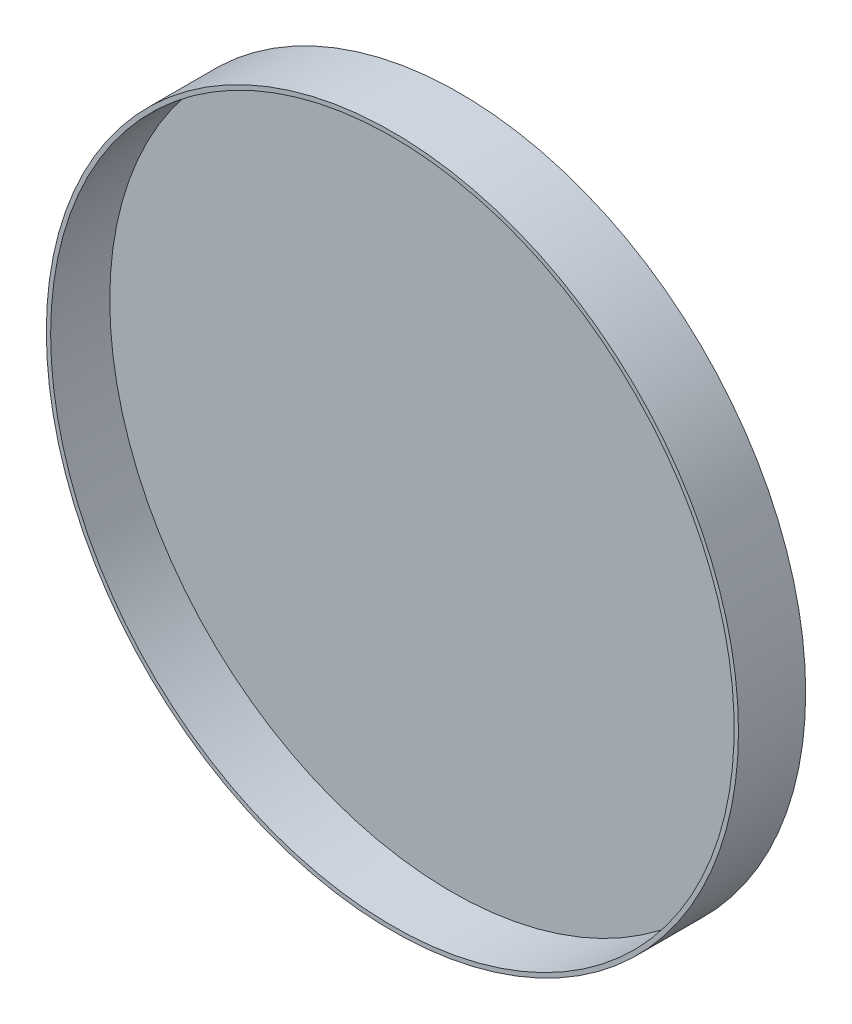
ISO-10303-21;
HEADER;
FILE_DESCRIPTION(('STEP AP214'),'2;1');
FILE_NAME('part.step','',(''),(''),'','','');
FILE_SCHEMA(('AUTOMOTIVE_DESIGN { 1 0 10303 214 1 1 1 1 }'));
ENDSEC;
DATA;
#1=APPLICATION_CONTEXT('core data for automotive mechanical design processes');
#2=APPLICATION_PROTOCOL_DEFINITION('international standard','automotive_design',2000,#1);
#3=PRODUCT_CONTEXT('',#1,'mechanical');
#4=PRODUCT('Part','Part','',(#3));
#5=PRODUCT_RELATED_PRODUCT_CATEGORY('part','',(#4));
#6=PRODUCT_DEFINITION_FORMATION('','',#4);
#7=PRODUCT_DEFINITION_CONTEXT('part definition',#1,'design');
#8=PRODUCT_DEFINITION('design','',#6,#7);
#9=PRODUCT_DEFINITION_SHAPE('','',#8);
#10=(LENGTH_UNIT() NAMED_UNIT(*) SI_UNIT(.MILLI.,.METRE.));
#11=(NAMED_UNIT(*) PLANE_ANGLE_UNIT() SI_UNIT($,.RADIAN.));
#12=(NAMED_UNIT(*) SI_UNIT($,.STERADIAN.) SOLID_ANGLE_UNIT());
#13=UNCERTAINTY_MEASURE_WITH_UNIT(LENGTH_MEASURE(1.E-05),#10,'distance_accuracy_value','');
#14=(GEOMETRIC_REPRESENTATION_CONTEXT(3) GLOBAL_UNCERTAINTY_ASSIGNED_CONTEXT((#13)) GLOBAL_UNIT_ASSIGNED_CONTEXT((#10,
#11,#12)) REPRESENTATION_CONTEXT('',''));
#15=CARTESIAN_POINT('',(0.,0.,0.));
#16=DIRECTION('',(0.,0.,1.));
#17=DIRECTION('',(1.,0.,0.));
#18=AXIS2_PLACEMENT_3D('',#15,#16,#17);
#19=CARTESIAN_POINT('',(0.,0.,0.));
#20=DIRECTION('',(0.,0.,-1.));
#21=DIRECTION('',(-1.,0.,0.));
#22=AXIS2_PLACEMENT_3D('',#19,#20,#21);
#23=PLANE('',#22);
#24=CARTESIAN_POINT('',(0.,0.,0.));
#25=DIRECTION('',(0.,0.,-1.));
#26=DIRECTION('',(-1.,0.,0.));
#27=AXIS2_PLACEMENT_3D('',#24,#25,#26);
#28=CIRCLE('',#27,32.2961);
#29=CARTESIAN_POINT('',(-32.2961,0.,0.));
#30=VERTEX_POINT('',#29);
#31=EDGE_CURVE('E25',#30,#30,#28,.F.);
#32=ORIENTED_EDGE('',*,*,#31,.T.);
#33=EDGE_LOOP('',(#32));
#34=FACE_BOUND('',#33,.T.);
#35=ADVANCED_FACE('F22',(#34),#23,.F.);
#36=CARTESIAN_POINT('',(0.,0.,5.588));
#37=DIRECTION('',(0.,0.,-1.));
#38=DIRECTION('',(-1.,0.,0.));
#39=AXIS2_PLACEMENT_3D('',#36,#37,#38);
#40=CYLINDRICAL_SURFACE('',#39,32.2961);
#41=CARTESIAN_POINT('',(0.,0.,5.588));
#42=DIRECTION('',(0.,0.,-1.));
#43=DIRECTION('',(-1.,0.,0.));
#44=AXIS2_PLACEMENT_3D('',#41,#42,#43);
#45=CIRCLE('',#44,32.2961);
#46=CARTESIAN_POINT('',(-32.2961,0.,5.588));
#47=VERTEX_POINT('',#46);
#48=EDGE_CURVE('E34',#47,#47,#45,.T.);
#49=ORIENTED_EDGE('',*,*,#48,.F.);
#50=EDGE_LOOP('',(#49));
#51=FACE_BOUND('',#50,.T.);
#52=ORIENTED_EDGE('',*,*,#31,.F.);
#53=EDGE_LOOP('',(#52));
#54=FACE_BOUND('',#53,.T.);
#55=ADVANCED_FACE('F43',(#51,#54),#40,.F.);
#56=CARTESIAN_POINT('',(0.,0.,5.588));
#57=DIRECTION('',(0.,0.,1.));
#58=DIRECTION('',(1.,0.,0.));
#59=AXIS2_PLACEMENT_3D('',#56,#57,#58);
#60=PLANE('',#59);
#61=ORIENTED_EDGE('',*,*,#48,.T.);
#62=EDGE_LOOP('',(#61));
#63=FACE_BOUND('',#62,.T.);
#64=CARTESIAN_POINT('',(0.,0.,5.588));
#65=DIRECTION('',(0.,0.,-1.));
#66=DIRECTION('',(-1.,0.,0.));
#67=AXIS2_PLACEMENT_3D('',#64,#65,#66);
#68=CIRCLE('',#67,32.7025);
#69=CARTESIAN_POINT('',(-32.7025,0.,5.588));
#70=VERTEX_POINT('',#69);
#71=EDGE_CURVE('E29',#70,#70,#68,.T.);
#72=ORIENTED_EDGE('',*,*,#71,.F.);
#73=EDGE_LOOP('',(#72));
#74=FACE_BOUND('',#73,.T.);
#75=ADVANCED_FACE('F45',(#63,#74),#60,.T.);
#76=CARTESIAN_POINT('',(0.,0.,5.588));
#77=DIRECTION('',(0.,0.,-1.));
#78=DIRECTION('',(-1.,0.,0.));
#79=AXIS2_PLACEMENT_3D('',#76,#77,#78);
#80=CYLINDRICAL_SURFACE('',#79,32.7025);
#81=ORIENTED_EDGE('',*,*,#71,.T.);
#82=EDGE_LOOP('',(#81));
#83=FACE_BOUND('',#82,.T.);
#84=CARTESIAN_POINT('',(0.,0.,-0.762));
#85=DIRECTION('',(0.,0.,-1.));
#86=DIRECTION('',(-1.,0.,0.));
#87=AXIS2_PLACEMENT_3D('',#84,#85,#86);
#88=CIRCLE('',#87,32.7025);
#89=CARTESIAN_POINT('',(-32.7025,0.,-0.762));
#90=VERTEX_POINT('',#89);
#91=EDGE_CURVE('E12',#90,#90,#88,.T.);
#92=ORIENTED_EDGE('',*,*,#91,.F.);
#93=EDGE_LOOP('',(#92));
#94=FACE_BOUND('',#93,.T.);
#95=ADVANCED_FACE('F52',(#83,#94),#80,.T.);
#96=CARTESIAN_POINT('',(0.,0.,-0.762));
#97=DIRECTION('',(0.,0.,-1.));
#98=DIRECTION('',(-1.,0.,0.));
#99=AXIS2_PLACEMENT_3D('',#96,#97,#98);
#100=PLANE('',#99);
#101=ORIENTED_EDGE('',*,*,#91,.T.);
#102=EDGE_LOOP('',(#101));
#103=FACE_BOUND('',#102,.T.);
#104=ADVANCED_FACE('F54',(#103),#100,.T.);
#105=CLOSED_SHELL('',(#35,#55,#75,#95,#104));
#106=MANIFOLD_SOLID_BREP('B1',#105);
#107=ADVANCED_BREP_SHAPE_REPRESENTATION('',(#18,#106),#14);
#108=SHAPE_DEFINITION_REPRESENTATION(#9,#107);
ENDSEC;
END-ISO-10303-21;
